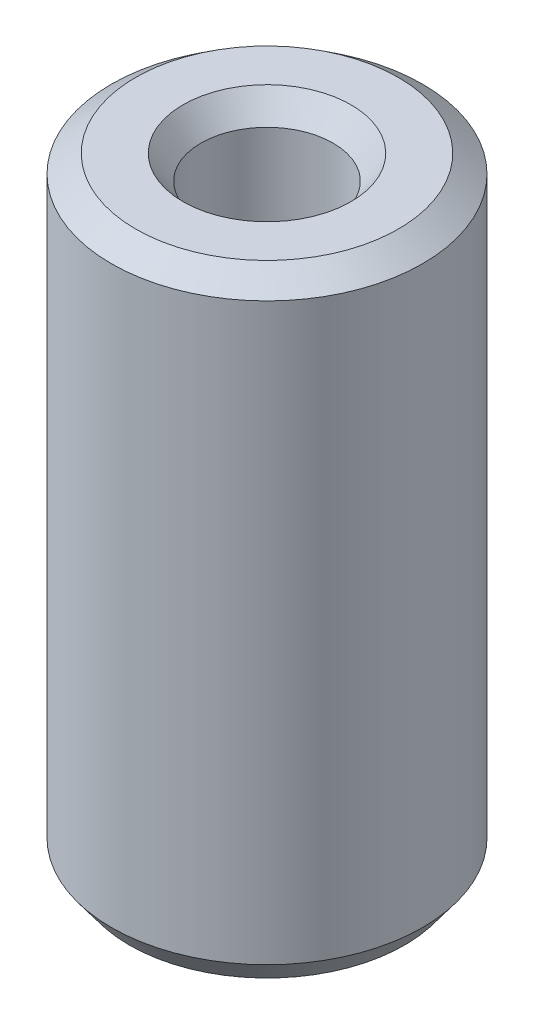
ISO-10303-21;
HEADER;
FILE_DESCRIPTION(('STEP AP214'),'2;1');
FILE_NAME('part.step','',(''),(''),'','','');
FILE_SCHEMA(('AUTOMOTIVE_DESIGN { 1 0 10303 214 1 1 1 1 }'));
ENDSEC;
DATA;
#1=APPLICATION_CONTEXT('core data for automotive mechanical design processes');
#2=APPLICATION_PROTOCOL_DEFINITION('international standard','automotive_design',2000,#1);
#3=PRODUCT_CONTEXT('',#1,'mechanical');
#4=PRODUCT('Part','Part','',(#3));
#5=PRODUCT_RELATED_PRODUCT_CATEGORY('part','',(#4));
#6=PRODUCT_DEFINITION_FORMATION('','',#4);
#7=PRODUCT_DEFINITION_CONTEXT('part definition',#1,'design');
#8=PRODUCT_DEFINITION('design','',#6,#7);
#9=PRODUCT_DEFINITION_SHAPE('','',#8);
#10=(LENGTH_UNIT() NAMED_UNIT(*) SI_UNIT(.MILLI.,.METRE.));
#11=(NAMED_UNIT(*) PLANE_ANGLE_UNIT() SI_UNIT($,.RADIAN.));
#12=(NAMED_UNIT(*) SI_UNIT($,.STERADIAN.) SOLID_ANGLE_UNIT());
#13=UNCERTAINTY_MEASURE_WITH_UNIT(LENGTH_MEASURE(1.E-05),#10,'distance_accuracy_value','');
#14=(GEOMETRIC_REPRESENTATION_CONTEXT(3) GLOBAL_UNCERTAINTY_ASSIGNED_CONTEXT((#13)) GLOBAL_UNIT_ASSIGNED_CONTEXT((#10,
#11,#12)) REPRESENTATION_CONTEXT('',''));
#15=CARTESIAN_POINT('',(0.,0.,0.));
#16=DIRECTION('',(0.,0.,1.));
#17=DIRECTION('',(1.,0.,0.));
#18=AXIS2_PLACEMENT_3D('',#15,#16,#17);
#19=CARTESIAN_POINT('',(0.,29.744460609625,0.));
#20=DIRECTION('',(0.,-1.,0.));
#21=DIRECTION('',(0.,0.,-1.));
#22=AXIS2_PLACEMENT_3D('',#19,#20,#21);
#23=CYLINDRICAL_SURFACE('',#22,7.5);
#24=CARTESIAN_POINT('',(0.,1.16744841508935,0.));
#25=DIRECTION('',(0.,1.,0.));
#26=DIRECTION('',(0.,0.,1.));
#27=AXIS2_PLACEMENT_3D('',#24,#25,#26);
#28=CIRCLE('',#27,7.5);
#29=CARTESIAN_POINT('',(0.,1.16744841508934,-7.5));
#30=VERTEX_POINT('',#29);
#31=EDGE_CURVE('E10',#30,#30,#28,.T.);
#32=CARTESIAN_POINT('',(0.,28.88025399184,0.));
#33=DIRECTION('',(0.,1.,0.));
#34=DIRECTION('',(0.,0.,1.));
#35=AXIS2_PLACEMENT_3D('',#32,#33,#34);
#36=CIRCLE('',#35,7.5);
#37=CARTESIAN_POINT('',(0.,28.88025399184,-7.5));
#38=VERTEX_POINT('',#37);
#39=EDGE_CURVE('E50',#38,#38,#36,.F.);
#40=CARTESIAN_POINT('',(0.,1.16744841508934,-7.5));
#41=CARTESIAN_POINT('',(0.,1.45612347318049,-7.5));
#42=CARTESIAN_POINT('',(0.,1.74479853127165,-7.5));
#43=CARTESIAN_POINT('',(0.,2.32214864745395,-7.5));
#44=CARTESIAN_POINT('',(0.,2.61082370554511,-7.5));
#45=CARTESIAN_POINT('',(0.,3.18817382172741,-7.5));
#46=CARTESIAN_POINT('',(0.,3.47684887981857,-7.5));
#47=CARTESIAN_POINT('',(0.,4.05419899600087,-7.5));
#48=CARTESIAN_POINT('',(0.,4.34287405409202,-7.5));
#49=CARTESIAN_POINT('',(0.,4.92022417027433,-7.5));
#50=CARTESIAN_POINT('',(0.,5.20889922836548,-7.5));
#51=CARTESIAN_POINT('',(0.,5.78624934454778,-7.5));
#52=CARTESIAN_POINT('',(0.,6.07492440263894,-7.5));
#53=CARTESIAN_POINT('',(0.,6.65227451882124,-7.5));
#54=CARTESIAN_POINT('',(0.,6.9409495769124,-7.5));
#55=CARTESIAN_POINT('',(0.,7.5182996930947,-7.5));
#56=CARTESIAN_POINT('',(0.,7.80697475118585,-7.5));
#57=CARTESIAN_POINT('',(0.,8.38432486736816,-7.5));
#58=CARTESIAN_POINT('',(0.,8.67299992545931,-7.5));
#59=CARTESIAN_POINT('',(0.,9.25035004164162,-7.5));
#60=CARTESIAN_POINT('',(0.,9.53902509973277,-7.5));
#61=CARTESIAN_POINT('',(0.,10.1163752159151,-7.5));
#62=CARTESIAN_POINT('',(0.,10.4050502740062,-7.5));
#63=CARTESIAN_POINT('',(0.,10.9824003901885,-7.5));
#64=CARTESIAN_POINT('',(0.,11.2710754482797,-7.5));
#65=CARTESIAN_POINT('',(0.,11.848425564462,-7.5));
#66=CARTESIAN_POINT('',(0.,12.1371006225531,-7.5));
#67=CARTESIAN_POINT('',(0.,12.7144507387354,-7.5));
#68=CARTESIAN_POINT('',(0.,13.0031257968266,-7.5));
#69=CARTESIAN_POINT('',(0.,13.5804759130089,-7.5));
#70=CARTESIAN_POINT('',(0.,13.8691509711001,-7.5));
#71=CARTESIAN_POINT('',(0.,14.4465010872824,-7.5));
#72=CARTESIAN_POINT('',(0.,14.7351761453735,-7.5));
#73=CARTESIAN_POINT('',(0.,15.3125262615558,-7.5));
#74=CARTESIAN_POINT('',(0.,15.601201319647,-7.5));
#75=CARTESIAN_POINT('',(0.,16.1785514358293,-7.5));
#76=CARTESIAN_POINT('',(0.,16.4672264939204,-7.5));
#77=CARTESIAN_POINT('',(0.,17.0445766101027,-7.5));
#78=CARTESIAN_POINT('',(0.,17.3332516681939,-7.5));
#79=CARTESIAN_POINT('',(0.,17.9106017843762,-7.5));
#80=CARTESIAN_POINT('',(0.,18.1992768424673,-7.5));
#81=CARTESIAN_POINT('',(0.,18.7766269586497,-7.5));
#82=CARTESIAN_POINT('',(0.,19.0653020167408,-7.5));
#83=CARTESIAN_POINT('',(0.,19.6426521329231,-7.5));
#84=CARTESIAN_POINT('',(0.,19.9313271910143,-7.5));
#85=CARTESIAN_POINT('',(0.,20.5086773071966,-7.5));
#86=CARTESIAN_POINT('',(0.,20.7973523652877,-7.5));
#87=CARTESIAN_POINT('',(0.,21.37470248147,-7.5));
#88=CARTESIAN_POINT('',(0.,21.6633775395612,-7.5));
#89=CARTESIAN_POINT('',(0.,22.2407276557435,-7.5));
#90=CARTESIAN_POINT('',(0.,22.5294027138346,-7.5));
#91=CARTESIAN_POINT('',(0.,23.1067528300169,-7.5));
#92=CARTESIAN_POINT('',(0.,23.3954278881081,-7.5));
#93=CARTESIAN_POINT('',(0.,23.9727780042904,-7.5));
#94=CARTESIAN_POINT('',(0.,24.2614530623816,-7.5));
#95=CARTESIAN_POINT('',(0.,24.8388031785639,-7.5));
#96=CARTESIAN_POINT('',(0.,25.127478236655,-7.5));
#97=CARTESIAN_POINT('',(0.,25.7048283528373,-7.5));
#98=CARTESIAN_POINT('',(0.,25.9935034109285,-7.5));
#99=CARTESIAN_POINT('',(0.,26.5708535271108,-7.5));
#100=CARTESIAN_POINT('',(0.,26.8595285852019,-7.5));
#101=CARTESIAN_POINT('',(0.,27.4368787013842,-7.5));
#102=CARTESIAN_POINT('',(0.,27.7255537594754,-7.5));
#103=CARTESIAN_POINT('',(0.,28.3029038756577,-7.5));
#104=CARTESIAN_POINT('',(0.,28.5915789337488,-7.5));
#105=CARTESIAN_POINT('',(0.,28.88025399184,-7.5));
#106=B_SPLINE_CURVE_WITH_KNOTS('',3,(#40,#41,#42,#43,#44,#45,#46,#47,#48,#49,#50,#51,#52,#53,
#54,#55,#56,#57,#58,#59,#60,#61,#62,#63,#64,#65,#66,#67,#68,#69,#70,#71,#72,#73,#74,#75,#76,#77,
#78,#79,#80,#81,#82,#83,#84,#85,#86,#87,#88,#89,#90,#91,#92,#93,#94,#95,#96,#97,#98,#99,#100,
#101,#102,#103,#104,#105),.UNSPECIFIED.,.F.,.F.,(4,2,2,2,2,2,2,2,2,2,2,2,2,2,2,2,2,2,2,2,2,2,2,
2,2,2,2,2,2,2,2,2,4),(0.,0.866025174273456,1.73205034854692,2.59807552282038,3.46410069709383,
4.33012587136729,5.19615104564075,6.06217621991421,6.92820139418766,7.79422656846112,
8.66025174273458,9.52627691700804,10.3923020912815,11.258327265555,12.1243524398284,
12.9903776141019,13.8564027883753,14.7224279626488,15.5884531369222,16.4544783111957,
17.3205034854692,18.1865286597426,19.0525538340161,19.9185790082895,20.784604182563,
21.6506293568364,22.5166545311099,23.3826797053834,24.2487048796568,25.1147300539303,
25.9807552282037,26.8467804024772,27.7128055767507),.UNSPECIFIED.);
#107=EDGE_CURVE('BSEAM39',#30,#38,#106,.T.);
#108=ORIENTED_EDGE('',*,*,#31,.T.);
#109=ORIENTED_EDGE('',*,*,#39,.T.);
#110=ORIENTED_EDGE('',*,*,#107,.T.);
#111=ORIENTED_EDGE('',*,*,#107,.F.);
#112=EDGE_LOOP('',(#108,#110,#109,#111));
#113=FACE_BOUND('',#112,.T.);
#114=ADVANCED_FACE('F39',(#113),#23,.T.);
#115=CARTESIAN_POINT('',(0.,29.744460609625,0.));
#116=DIRECTION('',(0.,1.,0.));
#117=DIRECTION('',(0.,0.,1.));
#118=AXIS2_PLACEMENT_3D('',#115,#116,#117);
#119=PLANE('',#118);
#120=CARTESIAN_POINT('',(0.,29.744460609625,0.));
#121=DIRECTION('',(0.,1.,0.));
#122=DIRECTION('',(0.,0.,1.));
#123=AXIS2_PLACEMENT_3D('',#120,#121,#122);
#124=CIRCLE('',#123,4.04864519009419);
#125=CARTESIAN_POINT('',(0.,29.744460609625,4.04864519009419));
#126=VERTEX_POINT('',#125);
#127=EDGE_CURVE('E58',#126,#126,#124,.F.);
#128=ORIENTED_EDGE('',*,*,#127,.T.);
#129=EDGE_LOOP('',(#128));
#130=FACE_BOUND('',#129,.T.);
#131=CARTESIAN_POINT('',(0.,29.744460609625,0.));
#132=DIRECTION('',(0.,1.,0.));
#133=DIRECTION('',(0.,0.,1.));
#134=AXIS2_PLACEMENT_3D('',#131,#132,#133);
#135=CIRCLE('',#134,6.3325515849107);
#136=CARTESIAN_POINT('',(0.,29.744460609625,6.3325515849107));
#137=VERTEX_POINT('',#136);
#138=EDGE_CURVE('E61',#137,#137,#135,.T.);
#139=ORIENTED_EDGE('',*,*,#138,.T.);
#140=EDGE_LOOP('',(#139));
#141=FACE_BOUND('',#140,.T.);
#142=ADVANCED_FACE('F88',(#130,#141),#119,.T.);
#143=CARTESIAN_POINT('',(0.,0.,0.));
#144=DIRECTION('',(0.,1.,0.));
#145=DIRECTION('',(0.,0.,1.));
#146=AXIS2_PLACEMENT_3D('',#143,#144,#145);
#147=PLANE('',#146);
#148=CARTESIAN_POINT('',(0.,0.,0.));
#149=DIRECTION('',(0.,1.,0.));
#150=DIRECTION('',(0.,0.,1.));
#151=AXIS2_PLACEMENT_3D('',#148,#149,#150);
#152=CIRCLE('',#151,4.35188698739845);
#153=CARTESIAN_POINT('',(0.,0.,4.35188698739845));
#154=VERTEX_POINT('',#153);
#155=EDGE_CURVE('E51',#154,#154,#152,.T.);
#156=ORIENTED_EDGE('',*,*,#155,.T.);
#157=EDGE_LOOP('',(#156));
#158=FACE_BOUND('',#157,.T.);
#159=CARTESIAN_POINT('',(0.,0.,0.));
#160=DIRECTION('',(0.,1.,0.));
#161=DIRECTION('',(0.,0.,1.));
#162=AXIS2_PLACEMENT_3D('',#159,#160,#161);
#163=CIRCLE('',#162,6.63579338221496);
#164=CARTESIAN_POINT('',(0.,0.,6.63579338221496));
#165=VERTEX_POINT('',#164);
#166=EDGE_CURVE('E54',#165,#165,#163,.F.);
#167=ORIENTED_EDGE('',*,*,#166,.T.);
#168=EDGE_LOOP('',(#167));
#169=FACE_BOUND('',#168,.T.);
#170=ADVANCED_FACE('F83',(#158,#169),#147,.F.);
#171=CARTESIAN_POINT('',(0.,29.744460609625,0.));
#172=DIRECTION('',(0.,-1.,0.));
#173=DIRECTION('',(0.,0.,-1.));
#174=AXIS2_PLACEMENT_3D('',#171,#172,#173);
#175=CYLINDRICAL_SURFACE('',#174,3.18443857230915);
#176=CARTESIAN_POINT('',(0.,28.5770121945357,0.));
#177=DIRECTION('',(0.,1.,0.));
#178=DIRECTION('',(0.,0.,1.));
#179=AXIS2_PLACEMENT_3D('',#176,#177,#178);
#180=CIRCLE('',#179,3.18443857230915);
#181=CARTESIAN_POINT('',(0.,28.5770121945357,-3.18443857230915));
#182=VERTEX_POINT('',#181);
#183=EDGE_CURVE('E67',#182,#182,#180,.T.);
#184=CARTESIAN_POINT('',(0.,0.864206617785007,0.));
#185=DIRECTION('',(0.,1.,0.));
#186=DIRECTION('',(0.,0.,1.));
#187=AXIS2_PLACEMENT_3D('',#184,#185,#186);
#188=CIRCLE('',#187,3.18443857230915);
#189=CARTESIAN_POINT('',(0.,0.864206617785007,-3.18443857230915));
#190=VERTEX_POINT('',#189);
#191=EDGE_CURVE('E69',#190,#190,#188,.F.);
#192=CARTESIAN_POINT('',(0.,28.5770121945357,-3.18443857230915));
#193=CARTESIAN_POINT('',(0.,28.2883371364445,-3.18443857230915));
#194=CARTESIAN_POINT('',(0.,27.9996620783534,-3.18443857230915));
#195=CARTESIAN_POINT('',(0.,27.422311962171,-3.18443857230915));
#196=CARTESIAN_POINT('',(0.,27.1336369040799,-3.18443857230915));
#197=CARTESIAN_POINT('',(0.,26.5562867878976,-3.18443857230915));
#198=CARTESIAN_POINT('',(0.,26.2676117298064,-3.18443857230915));
#199=CARTESIAN_POINT('',(0.,25.6902616136241,-3.18443857230915));
#200=CARTESIAN_POINT('',(0.,25.401586555533,-3.18443857230915));
#201=CARTESIAN_POINT('',(0.,24.8242364393507,-3.18443857230915));
#202=CARTESIAN_POINT('',(0.,24.5355613812595,-3.18443857230915));
#203=CARTESIAN_POINT('',(0.,23.9582112650772,-3.18443857230915));
#204=CARTESIAN_POINT('',(0.,23.6695362069861,-3.18443857230915));
#205=CARTESIAN_POINT('',(0.,23.0921860908038,-3.18443857230915));
#206=CARTESIAN_POINT('',(0.,22.8035110327126,-3.18443857230915));
#207=CARTESIAN_POINT('',(0.,22.2261609165303,-3.18443857230915));
#208=CARTESIAN_POINT('',(0.,21.9374858584391,-3.18443857230915));
#209=CARTESIAN_POINT('',(0.,21.3601357422568,-3.18443857230915));
#210=CARTESIAN_POINT('',(0.,21.0714606841657,-3.18443857230915));
#211=CARTESIAN_POINT('',(0.,20.4941105679834,-3.18443857230915));
#212=CARTESIAN_POINT('',(0.,20.2054355098922,-3.18443857230915));
#213=CARTESIAN_POINT('',(0.,19.6280853937099,-3.18443857230915));
#214=CARTESIAN_POINT('',(0.,19.3394103356188,-3.18443857230915));
#215=CARTESIAN_POINT('',(0.,18.7620602194365,-3.18443857230915));
#216=CARTESIAN_POINT('',(0.,18.4733851613453,-3.18443857230915));
#217=CARTESIAN_POINT('',(0.,17.896035045163,-3.18443857230915));
#218=CARTESIAN_POINT('',(0.,17.6073599870719,-3.18443857230915));
#219=CARTESIAN_POINT('',(0.,17.0300098708896,-3.18443857230915));
#220=CARTESIAN_POINT('',(0.,16.7413348127984,-3.18443857230915));
#221=CARTESIAN_POINT('',(0.,16.1639846966161,-3.18443857230915));
#222=CARTESIAN_POINT('',(0.,15.8753096385249,-3.18443857230915));
#223=CARTESIAN_POINT('',(0.,15.2979595223426,-3.18443857230915));
#224=CARTESIAN_POINT('',(0.,15.0092844642515,-3.18443857230915));
#225=CARTESIAN_POINT('',(0.,14.4319343480692,-3.18443857230915));
#226=CARTESIAN_POINT('',(0.,14.143259289978,-3.18443857230915));
#227=CARTESIAN_POINT('',(0.,13.5659091737957,-3.18443857230915));
#228=CARTESIAN_POINT('',(0.,13.2772341157046,-3.18443857230915));
#229=CARTESIAN_POINT('',(0.,12.6998839995223,-3.18443857230915));
#230=CARTESIAN_POINT('',(0.,12.4112089414311,-3.18443857230915));
#231=CARTESIAN_POINT('',(0.,11.8338588252488,-3.18443857230915));
#232=CARTESIAN_POINT('',(0.,11.5451837671577,-3.18443857230915));
#233=CARTESIAN_POINT('',(0.,10.9678336509753,-3.18443857230915));
#234=CARTESIAN_POINT('',(0.,10.6791585928842,-3.18443857230915));
#235=CARTESIAN_POINT('',(0.,10.1018084767019,-3.18443857230915));
#236=CARTESIAN_POINT('',(0.,9.81313341861074,-3.18443857230915));
#237=CARTESIAN_POINT('',(0.,9.23578330242844,-3.18443857230915));
#238=CARTESIAN_POINT('',(0.,8.94710824433728,-3.18443857230915));
#239=CARTESIAN_POINT('',(0.,8.36975812815497,-3.18443857230915));
#240=CARTESIAN_POINT('',(0.,8.08108307006382,-3.18443857230915));
#241=CARTESIAN_POINT('',(0.,7.50373295388152,-3.18443857230915));
#242=CARTESIAN_POINT('',(0.,7.21505789579037,-3.18443857230915));
#243=CARTESIAN_POINT('',(0.,6.63770777960806,-3.18443857230915));
#244=CARTESIAN_POINT('',(0.,6.34903272151691,-3.18443857230915));
#245=CARTESIAN_POINT('',(0.,5.7716826053346,-3.18443857230915));
#246=CARTESIAN_POINT('',(0.,5.48300754724345,-3.18443857230915));
#247=CARTESIAN_POINT('',(0.,4.90565743106114,-3.18443857230915));
#248=CARTESIAN_POINT('',(0.,4.61698237296999,-3.18443857230915));
#249=CARTESIAN_POINT('',(0.,4.03963225678769,-3.18443857230915));
#250=CARTESIAN_POINT('',(0.,3.75095719869653,-3.18443857230915));
#251=CARTESIAN_POINT('',(0.,3.17360708251423,-3.18443857230915));
#252=CARTESIAN_POINT('',(0.,2.88493202442308,-3.18443857230915));
#253=CARTESIAN_POINT('',(0.,2.30758190824077,-3.18443857230915));
#254=CARTESIAN_POINT('',(0.,2.01890685014962,-3.18443857230915));
#255=CARTESIAN_POINT('',(0.,1.44155673396731,-3.18443857230915));
#256=CARTESIAN_POINT('',(0.,1.15288167587616,-3.18443857230915));
#257=CARTESIAN_POINT('',(0.,0.864206617785007,-3.18443857230915));
#258=B_SPLINE_CURVE_WITH_KNOTS('',3,(#192,#193,#194,#195,#196,#197,#198,#199,#200,#201,#202,
#203,#204,#205,#206,#207,#208,#209,#210,#211,#212,#213,#214,#215,#216,#217,#218,#219,#220,#221,
#222,#223,#224,#225,#226,#227,#228,#229,#230,#231,#232,#233,#234,#235,#236,#237,#238,#239,#240,
#241,#242,#243,#244,#245,#246,#247,#248,#249,#250,#251,#252,#253,#254,#255,#256,#257),
.UNSPECIFIED.,.F.,.F.,(4,2,2,2,2,2,2,2,2,2,2,2,2,2,2,2,2,2,2,2,2,2,2,2,2,2,2,2,2,2,2,2,4),(0.,
0.86602517427346,1.73205034854692,2.59807552282038,3.46410069709383,4.33012587136729,
5.19615104564075,6.06217621991421,6.92820139418766,7.79422656846112,8.66025174273458,
9.52627691700804,10.3923020912815,11.258327265555,12.1243524398284,12.9903776141019,
13.8564027883753,14.7224279626488,15.5884531369222,16.4544783111957,17.3205034854692,
18.1865286597426,19.0525538340161,19.9185790082895,20.784604182563,21.6506293568364,
22.5166545311099,23.3826797053834,24.2487048796568,25.1147300539303,25.9807552282037,
26.8467804024772,27.7128055767507),.UNSPECIFIED.);
#259=EDGE_CURVE('BSEAM71',#182,#190,#258,.T.);
#260=ORIENTED_EDGE('',*,*,#183,.T.);
#261=ORIENTED_EDGE('',*,*,#191,.T.);
#262=ORIENTED_EDGE('',*,*,#259,.T.);
#263=ORIENTED_EDGE('',*,*,#259,.F.);
#264=EDGE_LOOP('',(#260,#262,#261,#263));
#265=FACE_BOUND('',#264,.T.);
#266=ADVANCED_FACE('F71',(#265),#175,.F.);
#267=CARTESIAN_POINT('',(0.,28.5770121945357,0.));
#268=DIRECTION('',(0.,1.,0.));
#269=DIRECTION('',(0.,0.,1.));
#270=AXIS2_PLACEMENT_3D('',#267,#268,#269);
#271=CONICAL_SURFACE('',#270,3.18443857230915,0.637233470907058);
#272=ORIENTED_EDGE('',*,*,#127,.F.);
#273=EDGE_LOOP('',(#272));
#274=FACE_BOUND('',#273,.T.);
#275=ORIENTED_EDGE('',*,*,#183,.F.);
#276=EDGE_LOOP('',(#275));
#277=FACE_BOUND('',#276,.T.);
#278=ADVANCED_FACE('F77',(#274,#277),#271,.F.);
#279=CARTESIAN_POINT('',(0.,0.,0.));
#280=DIRECTION('',(0.,-1.,0.));
#281=DIRECTION('',(0.,0.,-1.));
#282=AXIS2_PLACEMENT_3D('',#279,#280,#281);
#283=CONICAL_SURFACE('',#282,4.35188698739845,0.933562855887839);
#284=ORIENTED_EDGE('',*,*,#191,.F.);
#285=EDGE_LOOP('',(#284));
#286=FACE_BOUND('',#285,.T.);
#287=ORIENTED_EDGE('',*,*,#155,.F.);
#288=EDGE_LOOP('',(#287));
#289=FACE_BOUND('',#288,.T.);
#290=ADVANCED_FACE('F73',(#286,#289),#283,.F.);
#291=CARTESIAN_POINT('',(0.,1.16744841508935,0.));
#292=DIRECTION('',(0.,1.,0.));
#293=DIRECTION('',(0.,0.,1.));
#294=AXIS2_PLACEMENT_3D('',#291,#292,#293);
#295=CONICAL_SURFACE('',#294,7.5,0.637233470907057);
#296=ORIENTED_EDGE('',*,*,#166,.F.);
#297=EDGE_LOOP('',(#296));
#298=FACE_BOUND('',#297,.T.);
#299=ORIENTED_EDGE('',*,*,#31,.F.);
#300=EDGE_LOOP('',(#299));
#301=FACE_BOUND('',#300,.T.);
#302=ADVANCED_FACE('F76',(#298,#301),#295,.T.);
#303=CARTESIAN_POINT('',(0.,29.744460609625,0.));
#304=DIRECTION('',(0.,-1.,0.));
#305=DIRECTION('',(0.,0.,-1.));
#306=AXIS2_PLACEMENT_3D('',#303,#304,#305);
#307=CONICAL_SURFACE('',#306,6.3325515849107,0.933562855887842);
#308=ORIENTED_EDGE('',*,*,#39,.F.);
#309=EDGE_LOOP('',(#308));
#310=FACE_BOUND('',#309,.T.);
#311=ORIENTED_EDGE('',*,*,#138,.F.);
#312=EDGE_LOOP('',(#311));
#313=FACE_BOUND('',#312,.T.);
#314=ADVANCED_FACE('F45',(#310,#313),#307,.T.);
#315=CLOSED_SHELL('',(#114,#142,#170,#266,#278,#290,#302,#314));
#316=MANIFOLD_SOLID_BREP('B2',#315);
#317=ADVANCED_BREP_SHAPE_REPRESENTATION('',(#18,#316),#14);
#318=SHAPE_DEFINITION_REPRESENTATION(#9,#317);
ENDSEC;
END-ISO-10303-21;
